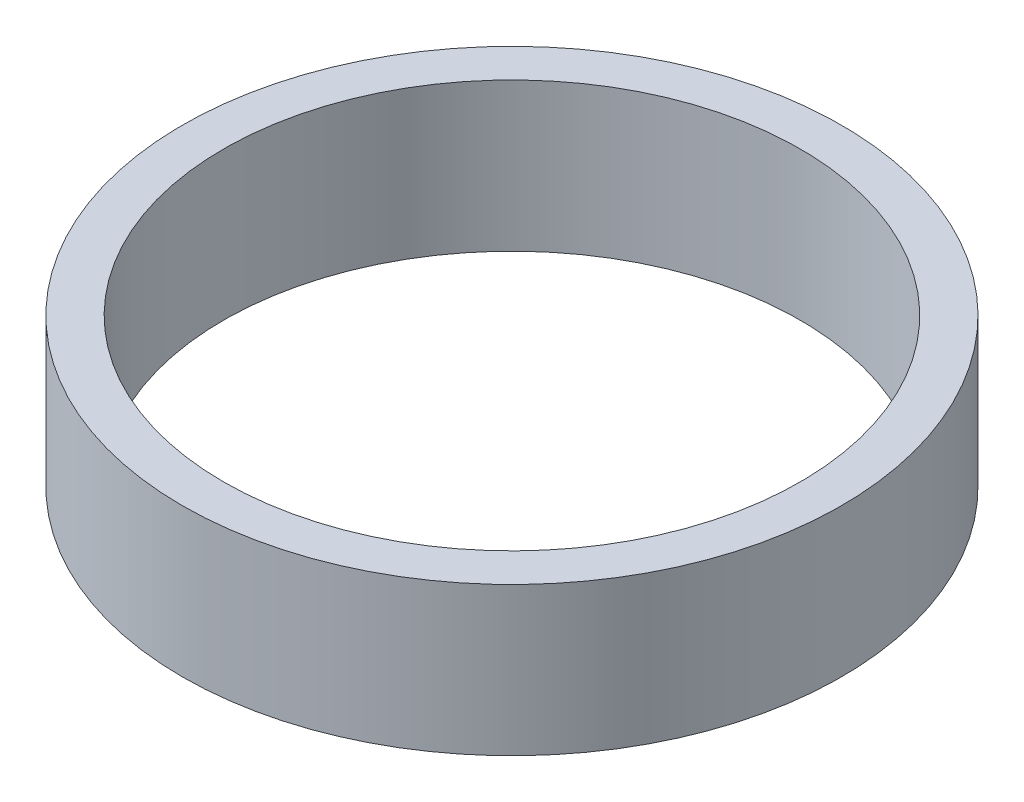
ISO-10303-21;
HEADER;
FILE_DESCRIPTION(('STEP AP214'),'2;1');
FILE_NAME('part.step','',(''),(''),'','','');
FILE_SCHEMA(('AUTOMOTIVE_DESIGN { 1 0 10303 214 1 1 1 1 }'));
ENDSEC;
DATA;
#1=APPLICATION_CONTEXT('core data for automotive mechanical design processes');
#2=APPLICATION_PROTOCOL_DEFINITION('international standard','automotive_design',2000,#1);
#3=PRODUCT_CONTEXT('',#1,'mechanical');
#4=PRODUCT('Part','Part','',(#3));
#5=PRODUCT_RELATED_PRODUCT_CATEGORY('part','',(#4));
#6=PRODUCT_DEFINITION_FORMATION('','',#4);
#7=PRODUCT_DEFINITION_CONTEXT('part definition',#1,'design');
#8=PRODUCT_DEFINITION('design','',#6,#7);
#9=PRODUCT_DEFINITION_SHAPE('','',#8);
#10=(LENGTH_UNIT() NAMED_UNIT(*) SI_UNIT(.MILLI.,.METRE.));
#11=(NAMED_UNIT(*) PLANE_ANGLE_UNIT() SI_UNIT($,.RADIAN.));
#12=(NAMED_UNIT(*) SI_UNIT($,.STERADIAN.) SOLID_ANGLE_UNIT());
#13=UNCERTAINTY_MEASURE_WITH_UNIT(LENGTH_MEASURE(1.E-05),#10,'distance_accuracy_value','');
#14=(GEOMETRIC_REPRESENTATION_CONTEXT(3) GLOBAL_UNCERTAINTY_ASSIGNED_CONTEXT((#13)) GLOBAL_UNIT_ASSIGNED_CONTEXT((#10,
#11,#12)) REPRESENTATION_CONTEXT('',''));
#15=CARTESIAN_POINT('',(0.,0.,0.));
#16=DIRECTION('',(0.,0.,1.));
#17=DIRECTION('',(1.,0.,0.));
#18=AXIS2_PLACEMENT_3D('',#15,#16,#17);
#19=CARTESIAN_POINT('',(0.,9.,0.));
#20=DIRECTION('',(0.,1.,0.));
#21=DIRECTION('',(0.,0.,1.));
#22=AXIS2_PLACEMENT_3D('',#19,#20,#21);
#23=PLANE('',#22);
#24=CARTESIAN_POINT('',(0.,9.,0.));
#25=DIRECTION('',(0.,1.,0.));
#26=DIRECTION('',(0.,0.,1.));
#27=AXIS2_PLACEMENT_3D('',#24,#25,#26);
#28=CIRCLE('',#27,20.);
#29=CARTESIAN_POINT('',(0.,9.,20.));
#30=VERTEX_POINT('',#29);
#31=EDGE_CURVE('E10',#30,#30,#28,.T.);
#32=ORIENTED_EDGE('',*,*,#31,.T.);
#33=EDGE_LOOP('',(#32));
#34=FACE_BOUND('',#33,.T.);
#35=CARTESIAN_POINT('',(0.,9.,0.));
#36=DIRECTION('',(0.,1.,0.));
#37=DIRECTION('',(0.,0.,1.));
#38=AXIS2_PLACEMENT_3D('',#35,#36,#37);
#39=CIRCLE('',#38,17.5);
#40=CARTESIAN_POINT('',(0.,9.,17.5));
#41=VERTEX_POINT('',#40);
#42=EDGE_CURVE('E50',#41,#41,#39,.T.);
#43=ORIENTED_EDGE('',*,*,#42,.F.);
#44=EDGE_LOOP('',(#43));
#45=FACE_BOUND('',#44,.T.);
#46=ADVANCED_FACE('F37',(#34,#45),#23,.T.);
#47=CARTESIAN_POINT('',(0.,0.,0.));
#48=DIRECTION('',(0.,1.,0.));
#49=DIRECTION('',(0.,0.,1.));
#50=AXIS2_PLACEMENT_3D('',#47,#48,#49);
#51=PLANE('',#50);
#52=CARTESIAN_POINT('',(0.,0.,0.));
#53=DIRECTION('',(0.,1.,0.));
#54=DIRECTION('',(0.,0.,1.));
#55=AXIS2_PLACEMENT_3D('',#52,#53,#54);
#56=CIRCLE('',#55,20.);
#57=CARTESIAN_POINT('',(0.,0.,20.));
#58=VERTEX_POINT('',#57);
#59=EDGE_CURVE('E41',#58,#58,#56,.T.);
#60=ORIENTED_EDGE('',*,*,#59,.F.);
#61=EDGE_LOOP('',(#60));
#62=FACE_BOUND('',#61,.T.);
#63=CARTESIAN_POINT('',(0.,0.,0.));
#64=DIRECTION('',(0.,1.,0.));
#65=DIRECTION('',(0.,0.,1.));
#66=AXIS2_PLACEMENT_3D('',#63,#64,#65);
#67=CIRCLE('',#66,17.5);
#68=CARTESIAN_POINT('',(0.,0.,17.5));
#69=VERTEX_POINT('',#68);
#70=EDGE_CURVE('E52',#69,#69,#67,.T.);
#71=ORIENTED_EDGE('',*,*,#70,.T.);
#72=EDGE_LOOP('',(#71));
#73=FACE_BOUND('',#72,.T.);
#74=ADVANCED_FACE('F64',(#62,#73),#51,.F.);
#75=CARTESIAN_POINT('',(0.,9.,0.));
#76=DIRECTION('',(0.,-1.,0.));
#77=DIRECTION('',(0.,0.,-1.));
#78=AXIS2_PLACEMENT_3D('',#75,#76,#77);
#79=CYLINDRICAL_SURFACE('',#78,20.);
#80=ORIENTED_EDGE('',*,*,#31,.F.);
#81=EDGE_LOOP('',(#80));
#82=FACE_BOUND('',#81,.T.);
#83=ORIENTED_EDGE('',*,*,#59,.T.);
#84=EDGE_LOOP('',(#83));
#85=FACE_BOUND('',#84,.T.);
#86=ADVANCED_FACE('F39',(#82,#85),#79,.T.);
#87=CARTESIAN_POINT('',(0.,9.,0.));
#88=DIRECTION('',(0.,-1.,0.));
#89=DIRECTION('',(0.,0.,-1.));
#90=AXIS2_PLACEMENT_3D('',#87,#88,#89);
#91=CYLINDRICAL_SURFACE('',#90,17.5);
#92=ORIENTED_EDGE('',*,*,#42,.T.);
#93=EDGE_LOOP('',(#92));
#94=FACE_BOUND('',#93,.T.);
#95=ORIENTED_EDGE('',*,*,#70,.F.);
#96=EDGE_LOOP('',(#95));
#97=FACE_BOUND('',#96,.T.);
#98=ADVANCED_FACE('F60',(#94,#97),#91,.F.);
#99=CLOSED_SHELL('',(#46,#74,#86,#98));
#100=MANIFOLD_SOLID_BREP('B2',#99);
#101=ADVANCED_BREP_SHAPE_REPRESENTATION('',(#18,#100),#14);
#102=SHAPE_DEFINITION_REPRESENTATION(#9,#101);
ENDSEC;
END-ISO-10303-21;
